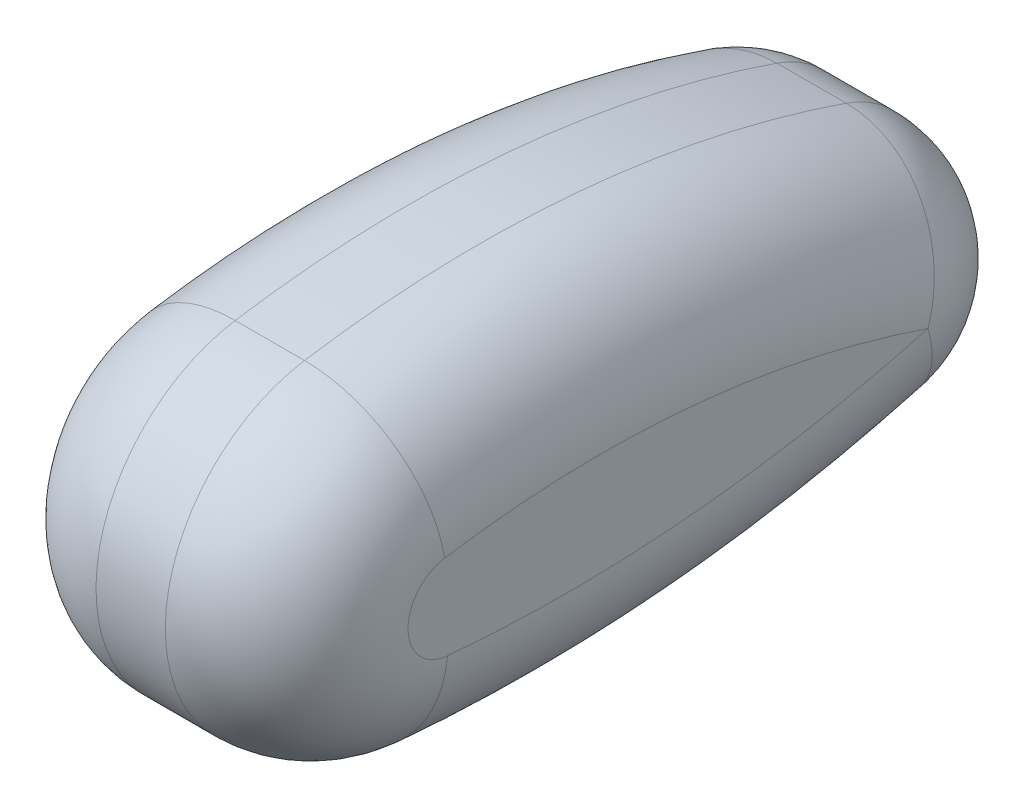
ISO-10303-21;
HEADER;
FILE_DESCRIPTION(('STEP AP214'),'2;1');
FILE_NAME('part.step','',(''),(''),'','','');
FILE_SCHEMA(('AUTOMOTIVE_DESIGN { 1 0 10303 214 1 1 1 1 }'));
ENDSEC;
DATA;
#1=APPLICATION_CONTEXT('core data for automotive mechanical design processes');
#2=APPLICATION_PROTOCOL_DEFINITION('international standard','automotive_design',2000,#1);
#3=PRODUCT_CONTEXT('',#1,'mechanical');
#4=PRODUCT('Part','Part','',(#3));
#5=PRODUCT_RELATED_PRODUCT_CATEGORY('part','',(#4));
#6=PRODUCT_DEFINITION_FORMATION('','',#4);
#7=PRODUCT_DEFINITION_CONTEXT('part definition',#1,'design');
#8=PRODUCT_DEFINITION('design','',#6,#7);
#9=PRODUCT_DEFINITION_SHAPE('','',#8);
#10=(LENGTH_UNIT() NAMED_UNIT(*) SI_UNIT(.MILLI.,.METRE.));
#11=(NAMED_UNIT(*) PLANE_ANGLE_UNIT() SI_UNIT($,.RADIAN.));
#12=(NAMED_UNIT(*) SI_UNIT($,.STERADIAN.) SOLID_ANGLE_UNIT());
#13=UNCERTAINTY_MEASURE_WITH_UNIT(LENGTH_MEASURE(1.E-05),#10,'distance_accuracy_value','');
#14=(GEOMETRIC_REPRESENTATION_CONTEXT(3) GLOBAL_UNCERTAINTY_ASSIGNED_CONTEXT((#13)) GLOBAL_UNIT_ASSIGNED_CONTEXT((#10,
#11,#12)) REPRESENTATION_CONTEXT('',''));
#15=CARTESIAN_POINT('',(0.,0.,0.));
#16=DIRECTION('',(0.,0.,1.));
#17=DIRECTION('',(1.,0.,0.));
#18=AXIS2_PLACEMENT_3D('',#15,#16,#17);
#19=CARTESIAN_POINT('',(-2.,75.1956126731424,-6.77272727272729));
#20=DIRECTION('',(-1.,0.,0.));
#21=DIRECTION('',(0.,0.,1.));
#22=AXIS2_PLACEMENT_3D('',#19,#20,#21);
#23=TOROIDAL_SURFACE('',#22,78.,7.);
#24=CARTESIAN_POINT('',(-2.,-2.48992094944181,0.224262492474415));
#25=DIRECTION('',(0.,0.0897049969897655,0.995968379776721));
#26=DIRECTION('',(0.,-0.995968379776721,0.0897049969897655));
#27=AXIS2_PLACEMENT_3D('',#24,#25,#26);
#28=CIRCLE('',#27,7.);
#29=CARTESIAN_POINT('',(-9.,-2.48992094944181,0.224262492474415));
#30=VERTEX_POINT('',#29);
#31=CARTESIAN_POINT('',(-2.,-9.46169960787885,0.852197471402773));
#32=VERTEX_POINT('',#31);
#33=EDGE_CURVE('E11',#30,#32,#28,.T.);
#34=ORIENTED_EDGE('',*,*,#33,.F.);
#35=CARTESIAN_POINT('',(-9.,75.1956126731424,-6.77272727272729));
#36=DIRECTION('',(-1.,0.,0.));
#37=DIRECTION('',(0.,0.,1.));
#38=AXIS2_PLACEMENT_3D('',#35,#36,#37);
#39=CIRCLE('',#38,78.);
#40=CARTESIAN_POINT('',(-9.,0.,-27.5));
#41=VERTEX_POINT('',#40);
#42=EDGE_CURVE('E219',#41,#30,#39,.T.);
#43=ORIENTED_EDGE('',*,*,#42,.F.);
#44=CARTESIAN_POINT('',(-2.,0.,-27.5));
#45=DIRECTION('',(0.,-0.265734265734264,0.964046316322339));
#46=DIRECTION('',(0.,-0.964046316322339,-0.265734265734264));
#47=AXIS2_PLACEMENT_3D('',#44,#45,#46);
#48=CIRCLE('',#47,7.);
#49=CARTESIAN_POINT('',(-2.,-6.74832421425639,-29.3601398601398));
#50=VERTEX_POINT('',#49);
#51=EDGE_CURVE('E37',#41,#50,#48,.T.);
#52=ORIENTED_EDGE('',*,*,#51,.T.);
#53=CARTESIAN_POINT('',(-2.,75.1956126731424,-6.77272727272729));
#54=DIRECTION('',(-1.,0.,0.));
#55=DIRECTION('',(0.,0.,1.));
#56=AXIS2_PLACEMENT_3D('',#53,#54,#55);
#57=CIRCLE('',#56,85.);
#58=EDGE_CURVE('E236',#32,#50,#57,.F.);
#59=ORIENTED_EDGE('',*,*,#58,.F.);
#60=EDGE_LOOP('',(#34,#43,#52,#59));
#61=FACE_BOUND('',#60,.T.);
#62=ADVANCED_FACE('F30',(#61),#23,.T.);
#63=CARTESIAN_POINT('',(-2.,0.,-27.5));
#64=DIRECTION('',(0.,0.,1.));
#65=DIRECTION('',(1.,0.,0.));
#66=AXIS2_PLACEMENT_3D('',#63,#64,#65);
#67=SPHERICAL_SURFACE('',#66,7.);
#68=ORIENTED_EDGE('',*,*,#51,.F.);
#69=CARTESIAN_POINT('',(-2.,0.,-27.5));
#70=DIRECTION('',(0.,-0.326018808777429,-0.945363282724343));
#71=DIRECTION('',(0.,0.945363282724343,-0.326018808777429));
#72=AXIS2_PLACEMENT_3D('',#69,#70,#71);
#73=CIRCLE('',#72,7.);
#74=CARTESIAN_POINT('',(-2.,6.61754297907041,-29.782131661442));
#75=VERTEX_POINT('',#74);
#76=EDGE_CURVE('E50',#41,#75,#73,.T.);
#77=ORIENTED_EDGE('',*,*,#76,.T.);
#78=CARTESIAN_POINT('',(-2.,0.,-27.5));
#79=DIRECTION('',(-1.,0.,0.));
#80=DIRECTION('',(0.,0.,1.));
#81=AXIS2_PLACEMENT_3D('',#78,#79,#80);
#82=CIRCLE('',#81,7.00000000000001);
#83=EDGE_CURVE('E234',#50,#75,#82,.F.);
#84=ORIENTED_EDGE('',*,*,#83,.F.);
#85=EDGE_LOOP('',(#68,#77,#84));
#86=FACE_BOUND('',#85,.T.);
#87=ADVANCED_FACE('F269',(#86),#67,.T.);
#88=CARTESIAN_POINT('',(-2.,-54.8310703980119,-8.59090909090909));
#89=DIRECTION('',(-1.,0.,0.));
#90=DIRECTION('',(0.,0.,1.));
#91=AXIS2_PLACEMENT_3D('',#88,#89,#90);
#92=TOROIDAL_SURFACE('',#91,58.,7.);
#93=ORIENTED_EDGE('',*,*,#76,.F.);
#94=CARTESIAN_POINT('',(-9.,-54.8310703980119,-8.59090909090909));
#95=DIRECTION('',(-1.,0.,0.));
#96=DIRECTION('',(0.,0.,1.));
#97=AXIS2_PLACEMENT_3D('',#94,#95,#96);
#98=CIRCLE('',#97,58.);
#99=CARTESIAN_POINT('',(-9.,2.46986803594649,0.386977886977889));
#100=VERTEX_POINT('',#99);
#101=EDGE_CURVE('E222',#100,#41,#98,.T.);
#102=ORIENTED_EDGE('',*,*,#101,.F.);
#103=CARTESIAN_POINT('',(-2.,2.46986803594649,0.386977886977888));
#104=DIRECTION('',(0.,0.154791154791155,-0.987947214378593));
#105=DIRECTION('',(0.,0.987947214378593,0.154791154791155));
#106=AXIS2_PLACEMENT_3D('',#103,#104,#105);
#107=CIRCLE('',#106,7.);
#108=CARTESIAN_POINT('',(-2.,9.38549853659664,1.47051597051597));
#109=VERTEX_POINT('',#108);
#110=EDGE_CURVE('E238',#100,#109,#107,.T.);
#111=ORIENTED_EDGE('',*,*,#110,.T.);
#112=CARTESIAN_POINT('',(-2.,-54.8310703980119,-8.59090909090909));
#113=DIRECTION('',(-1.,0.,0.));
#114=DIRECTION('',(0.,0.,1.));
#115=AXIS2_PLACEMENT_3D('',#112,#113,#114);
#116=CIRCLE('',#115,65.);
#117=EDGE_CURVE('E231',#75,#109,#116,.F.);
#118=ORIENTED_EDGE('',*,*,#117,.F.);
#119=EDGE_LOOP('',(#93,#102,#111,#118));
#120=FACE_BOUND('',#119,.T.);
#121=ADVANCED_FACE('F243',(#120),#92,.T.);
#122=CARTESIAN_POINT('',(-2.,0.,0.));
#123=DIRECTION('',(-1.,0.,0.));
#124=DIRECTION('',(0.,0.,1.));
#125=AXIS2_PLACEMENT_3D('',#122,#123,#124);
#126=DEGENERATE_TOROIDAL_SURFACE('',#125,2.50000000000001,7.,.T.);
#127=CARTESIAN_POINT('',(-9.,0.,0.));
#128=DIRECTION('',(-1.,0.,0.));
#129=DIRECTION('',(0.,0.,1.));
#130=AXIS2_PLACEMENT_3D('',#127,#128,#129);
#131=CIRCLE('',#130,2.50000000000001);
#132=EDGE_CURVE('E225',#30,#100,#131,.T.);
#133=ORIENTED_EDGE('',*,*,#132,.F.);
#134=ORIENTED_EDGE('',*,*,#33,.T.);
#135=CARTESIAN_POINT('',(-2.,0.,0.));
#136=DIRECTION('',(-1.,0.,0.));
#137=DIRECTION('',(0.,0.,1.));
#138=AXIS2_PLACEMENT_3D('',#135,#136,#137);
#139=CIRCLE('',#138,9.50000000000001);
#140=EDGE_CURVE('E228',#109,#32,#139,.F.);
#141=ORIENTED_EDGE('',*,*,#140,.F.);
#142=ORIENTED_EDGE('',*,*,#110,.F.);
#143=EDGE_LOOP('',(#133,#134,#141,#142));
#144=FACE_BOUND('',#143,.T.);
#145=ADVANCED_FACE('F251',(#144),#126,.T.);
#146=CARTESIAN_POINT('',(2.,75.1956126731424,-6.77272727272729));
#147=DIRECTION('',(-1.,0.,0.));
#148=DIRECTION('',(0.,0.,1.));
#149=AXIS2_PLACEMENT_3D('',#146,#147,#148);
#150=TOROIDAL_SURFACE('',#149,78.,7.);
#151=CARTESIAN_POINT('',(2.,0.,-27.5));
#152=DIRECTION('',(0.,0.265734265734265,-0.964046316322339));
#153=DIRECTION('',(0.,0.964046316322339,0.265734265734265));
#154=AXIS2_PLACEMENT_3D('',#151,#152,#153);
#155=CIRCLE('',#154,7.);
#156=CARTESIAN_POINT('',(9.,0.,-27.5));
#157=VERTEX_POINT('',#156);
#158=CARTESIAN_POINT('',(2.,-6.74832421425639,-29.3601398601398));
#159=VERTEX_POINT('',#158);
#160=EDGE_CURVE('E217',#157,#159,#155,.T.);
#161=ORIENTED_EDGE('',*,*,#160,.F.);
#162=CARTESIAN_POINT('',(9.,75.1956126731424,-6.77272727272729));
#163=DIRECTION('',(-1.,0.,0.));
#164=DIRECTION('',(0.,0.,1.));
#165=AXIS2_PLACEMENT_3D('',#162,#163,#164);
#166=CIRCLE('',#165,78.);
#167=CARTESIAN_POINT('',(9.,-2.48992094944181,0.224262492474415));
#168=VERTEX_POINT('',#167);
#169=EDGE_CURVE('E193',#168,#157,#166,.F.);
#170=ORIENTED_EDGE('',*,*,#169,.F.);
#171=CARTESIAN_POINT('',(2.,-2.48992094944181,0.224262492474414));
#172=DIRECTION('',(0.,-0.0897049969897655,-0.995968379776721));
#173=DIRECTION('',(0.,0.995968379776721,-0.0897049969897655));
#174=AXIS2_PLACEMENT_3D('',#171,#172,#173);
#175=CIRCLE('',#174,7.);
#176=CARTESIAN_POINT('',(2.,-9.46169960787885,0.852197471402773));
#177=VERTEX_POINT('',#176);
#178=EDGE_CURVE('E215',#168,#177,#175,.T.);
#179=ORIENTED_EDGE('',*,*,#178,.T.);
#180=CARTESIAN_POINT('',(2.,75.1956126731424,-6.77272727272729));
#181=DIRECTION('',(-1.,0.,0.));
#182=DIRECTION('',(0.,0.,1.));
#183=AXIS2_PLACEMENT_3D('',#180,#181,#182);
#184=CIRCLE('',#183,85.);
#185=EDGE_CURVE('E208',#159,#177,#184,.T.);
#186=ORIENTED_EDGE('',*,*,#185,.F.);
#187=EDGE_LOOP('',(#161,#170,#179,#186));
#188=FACE_BOUND('',#187,.T.);
#189=ADVANCED_FACE('F275',(#188),#150,.T.);
#190=CARTESIAN_POINT('',(2.,0.,0.));
#191=DIRECTION('',(-1.,0.,0.));
#192=DIRECTION('',(0.,0.,1.));
#193=AXIS2_PLACEMENT_3D('',#190,#191,#192);
#194=DEGENERATE_TOROIDAL_SURFACE('',#193,2.50000000000001,7.,.T.);
#195=ORIENTED_EDGE('',*,*,#178,.F.);
#196=CARTESIAN_POINT('',(9.,0.,0.));
#197=DIRECTION('',(-1.,0.,0.));
#198=DIRECTION('',(0.,0.,1.));
#199=AXIS2_PLACEMENT_3D('',#196,#197,#198);
#200=CIRCLE('',#199,2.50000000000001);
#201=CARTESIAN_POINT('',(9.,2.46986803594649,0.386977886977888));
#202=VERTEX_POINT('',#201);
#203=EDGE_CURVE('E196',#202,#168,#200,.F.);
#204=ORIENTED_EDGE('',*,*,#203,.F.);
#205=CARTESIAN_POINT('',(2.,2.46986803594649,0.386977886977889));
#206=DIRECTION('',(0.,-0.154791154791155,0.987947214378593));
#207=DIRECTION('',(0.,-0.987947214378593,-0.154791154791155));
#208=AXIS2_PLACEMENT_3D('',#205,#206,#207);
#209=CIRCLE('',#208,7.);
#210=CARTESIAN_POINT('',(2.,9.38549853659664,1.47051597051597));
#211=VERTEX_POINT('',#210);
#212=EDGE_CURVE('E213',#202,#211,#209,.T.);
#213=ORIENTED_EDGE('',*,*,#212,.T.);
#214=CARTESIAN_POINT('',(2.,0.,0.));
#215=DIRECTION('',(-1.,0.,0.));
#216=DIRECTION('',(0.,0.,1.));
#217=AXIS2_PLACEMENT_3D('',#214,#215,#216);
#218=CIRCLE('',#217,9.50000000000001);
#219=EDGE_CURVE('E205',#177,#211,#218,.T.);
#220=ORIENTED_EDGE('',*,*,#219,.F.);
#221=EDGE_LOOP('',(#195,#204,#213,#220));
#222=FACE_BOUND('',#221,.T.);
#223=ADVANCED_FACE('F278',(#222),#194,.T.);
#224=CARTESIAN_POINT('',(2.,-54.8310703980119,-8.59090909090909));
#225=DIRECTION('',(-1.,0.,0.));
#226=DIRECTION('',(0.,0.,1.));
#227=AXIS2_PLACEMENT_3D('',#224,#225,#226);
#228=TOROIDAL_SURFACE('',#227,58.,7.);
#229=ORIENTED_EDGE('',*,*,#212,.F.);
#230=CARTESIAN_POINT('',(9.,-54.8310703980119,-8.59090909090909));
#231=DIRECTION('',(-1.,0.,0.));
#232=DIRECTION('',(0.,0.,1.));
#233=AXIS2_PLACEMENT_3D('',#230,#231,#232);
#234=CIRCLE('',#233,58.);
#235=EDGE_CURVE('E199',#157,#202,#234,.F.);
#236=ORIENTED_EDGE('',*,*,#235,.F.);
#237=CARTESIAN_POINT('',(2.,0.,-27.5));
#238=DIRECTION('',(0.,0.326018808777429,0.945363282724343));
#239=DIRECTION('',(0.,-0.945363282724343,0.326018808777429));
#240=AXIS2_PLACEMENT_3D('',#237,#238,#239);
#241=CIRCLE('',#240,7.);
#242=CARTESIAN_POINT('',(2.,6.61754297907041,-29.782131661442));
#243=VERTEX_POINT('',#242);
#244=EDGE_CURVE('E211',#157,#243,#241,.T.);
#245=ORIENTED_EDGE('',*,*,#244,.T.);
#246=CARTESIAN_POINT('',(2.,-54.8310703980119,-8.59090909090909));
#247=DIRECTION('',(-1.,0.,0.));
#248=DIRECTION('',(0.,0.,1.));
#249=AXIS2_PLACEMENT_3D('',#246,#247,#248);
#250=CIRCLE('',#249,65.);
#251=EDGE_CURVE('E202',#211,#243,#250,.T.);
#252=ORIENTED_EDGE('',*,*,#251,.F.);
#253=EDGE_LOOP('',(#229,#236,#245,#252));
#254=FACE_BOUND('',#253,.T.);
#255=ADVANCED_FACE('F259',(#254),#228,.T.);
#256=CARTESIAN_POINT('',(2.,0.,-27.5));
#257=DIRECTION('',(0.,0.,1.));
#258=DIRECTION('',(1.,0.,0.));
#259=AXIS2_PLACEMENT_3D('',#256,#257,#258);
#260=SPHERICAL_SURFACE('',#259,7.);
#261=ORIENTED_EDGE('',*,*,#244,.F.);
#262=ORIENTED_EDGE('',*,*,#160,.T.);
#263=CARTESIAN_POINT('',(2.,0.,-27.5));
#264=DIRECTION('',(-1.,0.,0.));
#265=DIRECTION('',(0.,0.,1.));
#266=AXIS2_PLACEMENT_3D('',#263,#264,#265);
#267=CIRCLE('',#266,7.00000000000001);
#268=EDGE_CURVE('E190',#243,#159,#267,.T.);
#269=ORIENTED_EDGE('',*,*,#268,.F.);
#270=EDGE_LOOP('',(#261,#262,#269));
#271=FACE_BOUND('',#270,.T.);
#272=ADVANCED_FACE('F264',(#271),#260,.T.);
#273=CARTESIAN_POINT('',(9.,-54.8310703980119,-8.59090909090909));
#274=DIRECTION('',(-1.,0.,0.));
#275=DIRECTION('',(0.,0.,1.));
#276=AXIS2_PLACEMENT_3D('',#273,#274,#275);
#277=CYLINDRICAL_SURFACE('',#276,65.);
#278=DIRECTION('',(-1.,0.,0.));
#279=VECTOR('',#278,1.);
#280=CARTESIAN_POINT('',(9.,6.61754297907041,-29.782131661442));
#281=LINE('',#280,#279);
#282=EDGE_CURVE('E178',#243,#75,#281,.T.);
#283=ORIENTED_EDGE('',*,*,#282,.T.);
#284=ORIENTED_EDGE('',*,*,#117,.T.);
#285=DIRECTION('',(-1.,0.,0.));
#286=VECTOR('',#285,1.);
#287=CARTESIAN_POINT('',(9.,9.38549853659664,1.47051597051597));
#288=LINE('',#287,#286);
#289=EDGE_CURVE('E187',#211,#109,#288,.T.);
#290=ORIENTED_EDGE('',*,*,#289,.F.);
#291=ORIENTED_EDGE('',*,*,#251,.T.);
#292=EDGE_LOOP('',(#283,#284,#290,#291));
#293=FACE_BOUND('',#292,.T.);
#294=ADVANCED_FACE('F249',(#293),#277,.T.);
#295=CARTESIAN_POINT('',(9.,0.,0.));
#296=DIRECTION('',(-1.,0.,0.));
#297=DIRECTION('',(0.,0.,1.));
#298=AXIS2_PLACEMENT_3D('',#295,#296,#297);
#299=CYLINDRICAL_SURFACE('',#298,9.50000000000001);
#300=ORIENTED_EDGE('',*,*,#289,.T.);
#301=ORIENTED_EDGE('',*,*,#140,.T.);
#302=DIRECTION('',(-1.,0.,0.));
#303=VECTOR('',#302,1.);
#304=CARTESIAN_POINT('',(9.,-9.46169960787885,0.852197471402773));
#305=LINE('',#304,#303);
#306=EDGE_CURVE('E184',#177,#32,#305,.T.);
#307=ORIENTED_EDGE('',*,*,#306,.F.);
#308=ORIENTED_EDGE('',*,*,#219,.T.);
#309=EDGE_LOOP('',(#300,#301,#307,#308));
#310=FACE_BOUND('',#309,.T.);
#311=ADVANCED_FACE('F254',(#310),#299,.T.);
#312=CARTESIAN_POINT('',(9.,75.1956126731424,-6.77272727272729));
#313=DIRECTION('',(-1.,0.,0.));
#314=DIRECTION('',(0.,0.,1.));
#315=AXIS2_PLACEMENT_3D('',#312,#313,#314);
#316=CYLINDRICAL_SURFACE('',#315,85.);
#317=ORIENTED_EDGE('',*,*,#306,.T.);
#318=ORIENTED_EDGE('',*,*,#58,.T.);
#319=DIRECTION('',(-1.,0.,0.));
#320=VECTOR('',#319,1.);
#321=CARTESIAN_POINT('',(9.,-6.74832421425639,-29.3601398601398));
#322=LINE('',#321,#320);
#323=EDGE_CURVE('E181',#159,#50,#322,.T.);
#324=ORIENTED_EDGE('',*,*,#323,.F.);
#325=ORIENTED_EDGE('',*,*,#185,.T.);
#326=EDGE_LOOP('',(#317,#318,#324,#325));
#327=FACE_BOUND('',#326,.T.);
#328=ADVANCED_FACE('F273',(#327),#316,.T.);
#329=CARTESIAN_POINT('',(9.,0.,-27.5));
#330=DIRECTION('',(-1.,0.,0.));
#331=DIRECTION('',(0.,0.,1.));
#332=AXIS2_PLACEMENT_3D('',#329,#330,#331);
#333=CYLINDRICAL_SURFACE('',#332,7.00000000000001);
#334=ORIENTED_EDGE('',*,*,#323,.T.);
#335=ORIENTED_EDGE('',*,*,#83,.T.);
#336=ORIENTED_EDGE('',*,*,#282,.F.);
#337=ORIENTED_EDGE('',*,*,#268,.T.);
#338=EDGE_LOOP('',(#334,#335,#336,#337));
#339=FACE_BOUND('',#338,.T.);
#340=ADVANCED_FACE('F268',(#339),#333,.T.);
#341=CARTESIAN_POINT('',(9.,-27.4155351990059,-18.0454545454545));
#342=DIRECTION('',(-1.,0.,0.));
#343=DIRECTION('',(0.,0.,1.));
#344=AXIS2_PLACEMENT_3D('',#341,#342,#343);
#345=PLANE('',#344);
#346=ORIENTED_EDGE('',*,*,#169,.T.);
#347=ORIENTED_EDGE('',*,*,#235,.T.);
#348=ORIENTED_EDGE('',*,*,#203,.T.);
#349=EDGE_LOOP('',(#346,#347,#348));
#350=FACE_BOUND('',#349,.T.);
#351=ADVANCED_FACE('F280',(#350),#345,.F.);
#352=CARTESIAN_POINT('',(-9.,-27.4155351990059,-18.0454545454545));
#353=DIRECTION('',(-1.,0.,0.));
#354=DIRECTION('',(0.,0.,1.));
#355=AXIS2_PLACEMENT_3D('',#352,#353,#354);
#356=PLANE('',#355);
#357=ORIENTED_EDGE('',*,*,#42,.T.);
#358=ORIENTED_EDGE('',*,*,#132,.T.);
#359=ORIENTED_EDGE('',*,*,#101,.T.);
#360=EDGE_LOOP('',(#357,#358,#359));
#361=FACE_BOUND('',#360,.T.);
#362=ADVANCED_FACE('F271',(#361),#356,.T.);
#363=CLOSED_SHELL('',(#62,#87,#121,#145,#189,#223,#255,#272,#294,#311,#328,#340,#351,#362));
#364=CARTESIAN_POINT('',(-5.,2.00000000000001,-29.5));
#365=DIRECTION('',(1.,0.,0.));
#366=DIRECTION('',(0.,0.,-1.));
#367=AXIS2_PLACEMENT_3D('',#364,#365,#366);
#368=CYLINDRICAL_SURFACE('',#367,1.5);
#369=CARTESIAN_POINT('',(-5.,2.00000000000001,-29.5));
#370=DIRECTION('',(1.,0.,0.));
#371=DIRECTION('',(0.,0.,-1.));
#372=AXIS2_PLACEMENT_3D('',#369,#370,#371);
#373=CIRCLE('',#372,1.5);
#374=CARTESIAN_POINT('',(-5.,2.00000000000001,-31.));
#375=VERTEX_POINT('',#374);
#376=EDGE_CURVE('E175',#375,#375,#373,.T.);
#377=ORIENTED_EDGE('',*,*,#376,.F.);
#378=EDGE_LOOP('',(#377));
#379=FACE_BOUND('',#378,.T.);
#380=CARTESIAN_POINT('',(5.,2.00000000000001,-29.5));
#381=DIRECTION('',(1.,0.,0.));
#382=DIRECTION('',(0.,0.,-1.));
#383=AXIS2_PLACEMENT_3D('',#380,#381,#382);
#384=CIRCLE('',#383,1.5);
#385=CARTESIAN_POINT('',(5.,2.00000000000001,-31.));
#386=VERTEX_POINT('',#385);
#387=EDGE_CURVE('E172',#386,#386,#384,.T.);
#388=ORIENTED_EDGE('',*,*,#387,.T.);
#389=EDGE_LOOP('',(#388));
#390=FACE_BOUND('',#389,.T.);
#391=ADVANCED_FACE('F335',(#379,#390),#368,.F.);
#392=CARTESIAN_POINT('',(-5.,2.00000000000001,-29.5));
#393=DIRECTION('',(1.,0.,0.));
#394=DIRECTION('',(0.,0.,-1.));
#395=AXIS2_PLACEMENT_3D('',#392,#393,#394);
#396=PLANE('',#395);
#397=ORIENTED_EDGE('',*,*,#376,.T.);
#398=EDGE_LOOP('',(#397));
#399=FACE_BOUND('',#398,.T.);
#400=ADVANCED_FACE('F339',(#399),#396,.T.);
#401=CARTESIAN_POINT('',(5.,2.00000000000001,-29.5));
#402=DIRECTION('',(1.,0.,0.));
#403=DIRECTION('',(0.,0.,-1.));
#404=AXIS2_PLACEMENT_3D('',#401,#402,#403);
#405=PLANE('',#404);
#406=ORIENTED_EDGE('',*,*,#387,.F.);
#407=EDGE_LOOP('',(#406));
#408=FACE_BOUND('',#407,.T.);
#409=ADVANCED_FACE('F351',(#408),#405,.F.);
#410=CLOSED_SHELL('',(#391,#400,#409));
#411=CARTESIAN_POINT('',(-5.,3.50000000000001,3.50000000000001));
#412=DIRECTION('',(1.,0.,0.));
#413=DIRECTION('',(0.,0.,-1.));
#414=AXIS2_PLACEMENT_3D('',#411,#412,#413);
#415=CYLINDRICAL_SURFACE('',#414,1.5);
#416=CARTESIAN_POINT('',(-5.,3.50000000000001,3.50000000000001));
#417=DIRECTION('',(1.,0.,0.));
#418=DIRECTION('',(0.,0.,-1.));
#419=AXIS2_PLACEMENT_3D('',#416,#417,#418);
#420=CIRCLE('',#419,1.5);
#421=CARTESIAN_POINT('',(-5.,3.50000000000001,2.00000000000001));
#422=VERTEX_POINT('',#421);
#423=EDGE_CURVE('E169',#422,#422,#420,.T.);
#424=ORIENTED_EDGE('',*,*,#423,.F.);
#425=EDGE_LOOP('',(#424));
#426=FACE_BOUND('',#425,.T.);
#427=CARTESIAN_POINT('',(5.,3.50000000000001,3.50000000000001));
#428=DIRECTION('',(1.,0.,0.));
#429=DIRECTION('',(0.,0.,-1.));
#430=AXIS2_PLACEMENT_3D('',#427,#428,#429);
#431=CIRCLE('',#430,1.5);
#432=CARTESIAN_POINT('',(5.,3.50000000000001,2.00000000000001));
#433=VERTEX_POINT('',#432);
#434=EDGE_CURVE('E166',#433,#433,#431,.T.);
#435=ORIENTED_EDGE('',*,*,#434,.T.);
#436=EDGE_LOOP('',(#435));
#437=FACE_BOUND('',#436,.T.);
#438=ADVANCED_FACE('F368',(#426,#437),#415,.F.);
#439=CARTESIAN_POINT('',(-5.,3.50000000000001,3.50000000000001));
#440=DIRECTION('',(1.,0.,0.));
#441=DIRECTION('',(0.,0.,-1.));
#442=AXIS2_PLACEMENT_3D('',#439,#440,#441);
#443=PLANE('',#442);
#444=ORIENTED_EDGE('',*,*,#423,.T.);
#445=EDGE_LOOP('',(#444));
#446=FACE_BOUND('',#445,.T.);
#447=ADVANCED_FACE('F371',(#446),#443,.T.);
#448=CARTESIAN_POINT('',(5.,3.50000000000001,3.50000000000001));
#449=DIRECTION('',(1.,0.,0.));
#450=DIRECTION('',(0.,0.,-1.));
#451=AXIS2_PLACEMENT_3D('',#448,#449,#450);
#452=PLANE('',#451);
#453=ORIENTED_EDGE('',*,*,#434,.F.);
#454=EDGE_LOOP('',(#453));
#455=FACE_BOUND('',#454,.T.);
#456=ADVANCED_FACE('F383',(#455),#452,.F.);
#457=CLOSED_SHELL('',(#438,#447,#456));
#458=CARTESIAN_POINT('',(-5.,4.50000000000001,-29.5000000000001));
#459=DIRECTION('',(1.,0.,0.));
#460=DIRECTION('',(0.,0.,-1.));
#461=AXIS2_PLACEMENT_3D('',#458,#459,#460);
#462=CYLINDRICAL_SURFACE('',#461,0.750000000000002);
#463=CARTESIAN_POINT('',(-5.,4.50000000000001,-29.5000000000001));
#464=DIRECTION('',(1.,0.,0.));
#465=DIRECTION('',(0.,0.,-1.));
#466=AXIS2_PLACEMENT_3D('',#463,#464,#465);
#467=CIRCLE('',#466,0.750000000000002);
#468=CARTESIAN_POINT('',(-5.,4.50000000000001,-30.2500000000001));
#469=VERTEX_POINT('',#468);
#470=EDGE_CURVE('E163',#469,#469,#467,.T.);
#471=ORIENTED_EDGE('',*,*,#470,.F.);
#472=EDGE_LOOP('',(#471));
#473=FACE_BOUND('',#472,.T.);
#474=CARTESIAN_POINT('',(5.,4.50000000000001,-29.5000000000001));
#475=DIRECTION('',(1.,0.,0.));
#476=DIRECTION('',(0.,0.,-1.));
#477=AXIS2_PLACEMENT_3D('',#474,#475,#476);
#478=CIRCLE('',#477,0.750000000000002);
#479=CARTESIAN_POINT('',(5.,4.50000000000001,-30.2500000000001));
#480=VERTEX_POINT('',#479);
#481=EDGE_CURVE('E160',#480,#480,#478,.T.);
#482=ORIENTED_EDGE('',*,*,#481,.T.);
#483=EDGE_LOOP('',(#482));
#484=FACE_BOUND('',#483,.T.);
#485=ADVANCED_FACE('F400',(#473,#484),#462,.F.);
#486=CARTESIAN_POINT('',(-5.,4.50000000000001,-29.5000000000001));
#487=DIRECTION('',(1.,0.,0.));
#488=DIRECTION('',(0.,0.,-1.));
#489=AXIS2_PLACEMENT_3D('',#486,#487,#488);
#490=PLANE('',#489);
#491=CARTESIAN_POINT('',(-5.,4.50000000000001,-29.5000000000001));
#492=DIRECTION('',(1.,0.,0.));
#493=DIRECTION('',(0.,0.,-1.));
#494=AXIS2_PLACEMENT_3D('',#491,#492,#493);
#495=CIRCLE('',#494,0.499999999999999);
#496=CARTESIAN_POINT('',(-5.,4.50000000000001,-30.0000000000001));
#497=VERTEX_POINT('',#496);
#498=EDGE_CURVE('E157',#497,#497,#495,.T.);
#499=ORIENTED_EDGE('',*,*,#498,.F.);
#500=EDGE_LOOP('',(#499));
#501=FACE_BOUND('',#500,.T.);
#502=ORIENTED_EDGE('',*,*,#470,.T.);
#503=EDGE_LOOP('',(#502));
#504=FACE_BOUND('',#503,.T.);
#505=ADVANCED_FACE('F403',(#501,#504),#490,.T.);
#506=CARTESIAN_POINT('',(5.,4.50000000000001,-29.5000000000001));
#507=DIRECTION('',(1.,0.,0.));
#508=DIRECTION('',(0.,0.,-1.));
#509=AXIS2_PLACEMENT_3D('',#506,#507,#508);
#510=PLANE('',#509);
#511=CARTESIAN_POINT('',(5.,4.50000000000001,-29.5000000000001));
#512=DIRECTION('',(1.,0.,0.));
#513=DIRECTION('',(0.,0.,-1.));
#514=AXIS2_PLACEMENT_3D('',#511,#512,#513);
#515=CIRCLE('',#514,0.499999999999999);
#516=CARTESIAN_POINT('',(5.,4.50000000000001,-30.0000000000001));
#517=VERTEX_POINT('',#516);
#518=EDGE_CURVE('E151',#517,#517,#515,.T.);
#519=ORIENTED_EDGE('',*,*,#518,.T.);
#520=EDGE_LOOP('',(#519));
#521=FACE_BOUND('',#520,.T.);
#522=ORIENTED_EDGE('',*,*,#481,.F.);
#523=EDGE_LOOP('',(#522));
#524=FACE_BOUND('',#523,.T.);
#525=ADVANCED_FACE('F415',(#521,#524),#510,.F.);
#526=CARTESIAN_POINT('',(-5.,4.50000000000001,-29.5000000000001));
#527=DIRECTION('',(1.,0.,0.));
#528=DIRECTION('',(0.,0.,-1.));
#529=AXIS2_PLACEMENT_3D('',#526,#527,#528);
#530=CYLINDRICAL_SURFACE('',#529,0.499999999999999);
#531=ORIENTED_EDGE('',*,*,#498,.T.);
#532=EDGE_LOOP('',(#531));
#533=FACE_BOUND('',#532,.T.);
#534=ORIENTED_EDGE('',*,*,#518,.F.);
#535=EDGE_LOOP('',(#534));
#536=FACE_BOUND('',#535,.T.);
#537=ADVANCED_FACE('F425',(#533,#536),#530,.T.);
#538=CLOSED_SHELL('',(#485,#505,#525,#537));
#539=CARTESIAN_POINT('',(-5.,3.50000000000001,3.50000000000001));
#540=DIRECTION('',(1.,0.,0.));
#541=DIRECTION('',(0.,0.,-1.));
#542=AXIS2_PLACEMENT_3D('',#539,#540,#541);
#543=CYLINDRICAL_SURFACE('',#542,3.);
#544=CARTESIAN_POINT('',(5.,3.50000000000001,3.50000000000001));
#545=DIRECTION('',(1.,0.,0.));
#546=DIRECTION('',(0.,0.,-1.));
#547=AXIS2_PLACEMENT_3D('',#544,#545,#546);
#548=CIRCLE('',#547,3.);
#549=CARTESIAN_POINT('',(5.,6.50000000000001,3.50000000000001));
#550=VERTEX_POINT('',#549);
#551=CARTESIAN_POINT('',(5.,2.473939570023,6.31907786235773));
#552=VERTEX_POINT('',#551);
#553=EDGE_CURVE('E130',#550,#552,#548,.T.);
#554=ORIENTED_EDGE('',*,*,#553,.T.);
#555=DIRECTION('',(1.,0.,0.));
#556=VECTOR('',#555,1.);
#557=CARTESIAN_POINT('',(-5.,2.473939570023,6.31907786235773));
#558=LINE('',#557,#556);
#559=CARTESIAN_POINT('',(-5.,2.473939570023,6.31907786235773));
#560=VERTEX_POINT('',#559);
#561=EDGE_CURVE('E112',#560,#552,#558,.T.);
#562=ORIENTED_EDGE('',*,*,#561,.F.);
#563=CARTESIAN_POINT('',(-5.,3.50000000000001,3.50000000000001));
#564=DIRECTION('',(1.,0.,0.));
#565=DIRECTION('',(0.,0.,-1.));
#566=AXIS2_PLACEMENT_3D('',#563,#564,#565);
#567=CIRCLE('',#566,3.);
#568=CARTESIAN_POINT('',(-5.,6.50000000000001,3.50000000000001));
#569=VERTEX_POINT('',#568);
#570=EDGE_CURVE('E142',#569,#560,#567,.T.);
#571=ORIENTED_EDGE('',*,*,#570,.F.);
#572=DIRECTION('',(1.,0.,0.));
#573=VECTOR('',#572,1.);
#574=CARTESIAN_POINT('',(-5.,6.50000000000001,3.50000000000001));
#575=LINE('',#574,#573);
#576=EDGE_CURVE('E136',#569,#550,#575,.T.);
#577=ORIENTED_EDGE('',*,*,#576,.T.);
#578=EDGE_LOOP('',(#554,#562,#571,#577));
#579=FACE_BOUND('',#578,.T.);
#580=ADVANCED_FACE('F135',(#579),#543,.F.);
#581=CARTESIAN_POINT('',(-5.,6.00000000000001,3.50000000000001));
#582=DIRECTION('',(1.,0.,0.));
#583=DIRECTION('',(0.,0.,-1.));
#584=AXIS2_PLACEMENT_3D('',#581,#582,#583);
#585=CYLINDRICAL_SURFACE('',#584,0.5);
#586=CARTESIAN_POINT('',(5.,6.00000000000001,3.50000000000001));
#587=DIRECTION('',(1.,0.,0.));
#588=DIRECTION('',(0.,0.,-1.));
#589=AXIS2_PLACEMENT_3D('',#586,#587,#588);
#590=CIRCLE('',#589,0.5);
#591=CARTESIAN_POINT('',(5.,5.50000000000001,3.50000000000001));
#592=VERTEX_POINT('',#591);
#593=EDGE_CURVE('E140',#592,#550,#590,.T.);
#594=ORIENTED_EDGE('',*,*,#593,.T.);
#595=ORIENTED_EDGE('',*,*,#576,.F.);
#596=CARTESIAN_POINT('',(-5.,6.00000000000001,3.50000000000001));
#597=DIRECTION('',(1.,0.,0.));
#598=DIRECTION('',(0.,0.,-1.));
#599=AXIS2_PLACEMENT_3D('',#596,#597,#598);
#600=CIRCLE('',#599,0.5);
#601=CARTESIAN_POINT('',(-5.,5.50000000000001,3.50000000000001));
#602=VERTEX_POINT('',#601);
#603=EDGE_CURVE('E123',#602,#569,#600,.T.);
#604=ORIENTED_EDGE('',*,*,#603,.F.);
#605=DIRECTION('',(1.,0.,0.));
#606=VECTOR('',#605,1.);
#607=CARTESIAN_POINT('',(-5.,5.50000000000001,3.50000000000001));
#608=LINE('',#607,#606);
#609=EDGE_CURVE('E152',#602,#592,#608,.T.);
#610=ORIENTED_EDGE('',*,*,#609,.T.);
#611=EDGE_LOOP('',(#594,#595,#604,#610));
#612=FACE_BOUND('',#611,.T.);
#613=ADVANCED_FACE('F444',(#612),#585,.F.);
#614=CARTESIAN_POINT('',(-5.,3.50000000000001,3.50000000000001));
#615=DIRECTION('',(1.,0.,0.));
#616=DIRECTION('',(0.,0.,-1.));
#617=AXIS2_PLACEMENT_3D('',#614,#615,#616);
#618=CYLINDRICAL_SURFACE('',#617,2.);
#619=CARTESIAN_POINT('',(5.,3.50000000000001,3.50000000000001));
#620=DIRECTION('',(-1.,0.,0.));
#621=DIRECTION('',(0.,0.,-1.));
#622=AXIS2_PLACEMENT_3D('',#619,#620,#621);
#623=CIRCLE('',#622,2.);
#624=CARTESIAN_POINT('',(5.,2.81595971334867,5.37938524157182));
#625=VERTEX_POINT('',#624);
#626=EDGE_CURVE('E133',#625,#592,#623,.T.);
#627=ORIENTED_EDGE('',*,*,#626,.T.);
#628=ORIENTED_EDGE('',*,*,#609,.F.);
#629=CARTESIAN_POINT('',(-5.,3.50000000000001,3.50000000000001));
#630=DIRECTION('',(-1.,0.,0.));
#631=DIRECTION('',(0.,0.,-1.));
#632=AXIS2_PLACEMENT_3D('',#629,#630,#631);
#633=CIRCLE('',#632,2.);
#634=CARTESIAN_POINT('',(-5.,2.81595971334867,5.37938524157182));
#635=VERTEX_POINT('',#634);
#636=EDGE_CURVE('E145',#635,#602,#633,.T.);
#637=ORIENTED_EDGE('',*,*,#636,.F.);
#638=DIRECTION('',(1.,0.,0.));
#639=VECTOR('',#638,1.);
#640=CARTESIAN_POINT('',(-5.,2.81595971334867,5.37938524157182));
#641=LINE('',#640,#639);
#642=EDGE_CURVE('E122',#635,#625,#641,.T.);
#643=ORIENTED_EDGE('',*,*,#642,.T.);
#644=EDGE_LOOP('',(#627,#628,#637,#643));
#645=FACE_BOUND('',#644,.T.);
#646=ADVANCED_FACE('F455',(#645),#618,.T.);
#647=CARTESIAN_POINT('',(-5.,2.64494964168583,5.84923155196478));
#648=DIRECTION('',(1.,0.,0.));
#649=DIRECTION('',(0.,0.,-1.));
#650=AXIS2_PLACEMENT_3D('',#647,#648,#649);
#651=CYLINDRICAL_SURFACE('',#650,0.500000000000001);
#652=CARTESIAN_POINT('',(5.,2.64494964168583,5.84923155196478));
#653=DIRECTION('',(1.,0.,0.));
#654=DIRECTION('',(0.,0.,-1.));
#655=AXIS2_PLACEMENT_3D('',#652,#653,#654);
#656=CIRCLE('',#655,0.500000000000001);
#657=EDGE_CURVE('E115',#552,#625,#656,.T.);
#658=ORIENTED_EDGE('',*,*,#657,.T.);
#659=ORIENTED_EDGE('',*,*,#642,.F.);
#660=CARTESIAN_POINT('',(-5.,2.64494964168583,5.84923155196478));
#661=DIRECTION('',(1.,0.,0.));
#662=DIRECTION('',(0.,0.,-1.));
#663=AXIS2_PLACEMENT_3D('',#660,#661,#662);
#664=CIRCLE('',#663,0.500000000000001);
#665=EDGE_CURVE('E117',#560,#635,#664,.T.);
#666=ORIENTED_EDGE('',*,*,#665,.F.);
#667=ORIENTED_EDGE('',*,*,#561,.T.);
#668=EDGE_LOOP('',(#658,#659,#666,#667));
#669=FACE_BOUND('',#668,.T.);
#670=ADVANCED_FACE('F114',(#669),#651,.F.);
#671=CARTESIAN_POINT('',(-5.,3.07247482084292,4.67461577598239));
#672=DIRECTION('',(1.,0.,0.));
#673=DIRECTION('',(0.,0.,-1.));
#674=AXIS2_PLACEMENT_3D('',#671,#672,#673);
#675=PLANE('',#674);
#676=ORIENTED_EDGE('',*,*,#570,.T.);
#677=ORIENTED_EDGE('',*,*,#665,.T.);
#678=ORIENTED_EDGE('',*,*,#636,.T.);
#679=ORIENTED_EDGE('',*,*,#603,.T.);
#680=EDGE_LOOP('',(#676,#677,#678,#679));
#681=FACE_BOUND('',#680,.T.);
#682=ADVANCED_FACE('F474',(#681),#675,.T.);
#683=CARTESIAN_POINT('',(5.,3.07247482084292,4.67461577598239));
#684=DIRECTION('',(1.,0.,0.));
#685=DIRECTION('',(0.,0.,-1.));
#686=AXIS2_PLACEMENT_3D('',#683,#684,#685);
#687=PLANE('',#686);
#688=ORIENTED_EDGE('',*,*,#553,.F.);
#689=ORIENTED_EDGE('',*,*,#593,.F.);
#690=ORIENTED_EDGE('',*,*,#626,.F.);
#691=ORIENTED_EDGE('',*,*,#657,.F.);
#692=EDGE_LOOP('',(#688,#689,#690,#691));
#693=FACE_BOUND('',#692,.T.);
#694=ADVANCED_FACE('F128',(#693),#687,.F.);
#695=CLOSED_SHELL('',(#580,#613,#646,#670,#682,#694));
#696=ORIENTED_CLOSED_SHELL('',*,#410,.T.);
#697=ORIENTED_CLOSED_SHELL('',*,#457,.T.);
#698=ORIENTED_CLOSED_SHELL('',*,#538,.T.);
#699=ORIENTED_CLOSED_SHELL('',*,#695,.T.);
#700=BREP_WITH_VOIDS('B2',#363,(#696,#697,#698,#699));
#701=ADVANCED_BREP_SHAPE_REPRESENTATION('',(#18,#700),#14);
#702=SHAPE_DEFINITION_REPRESENTATION(#9,#701);
ENDSEC;
END-ISO-10303-21;
